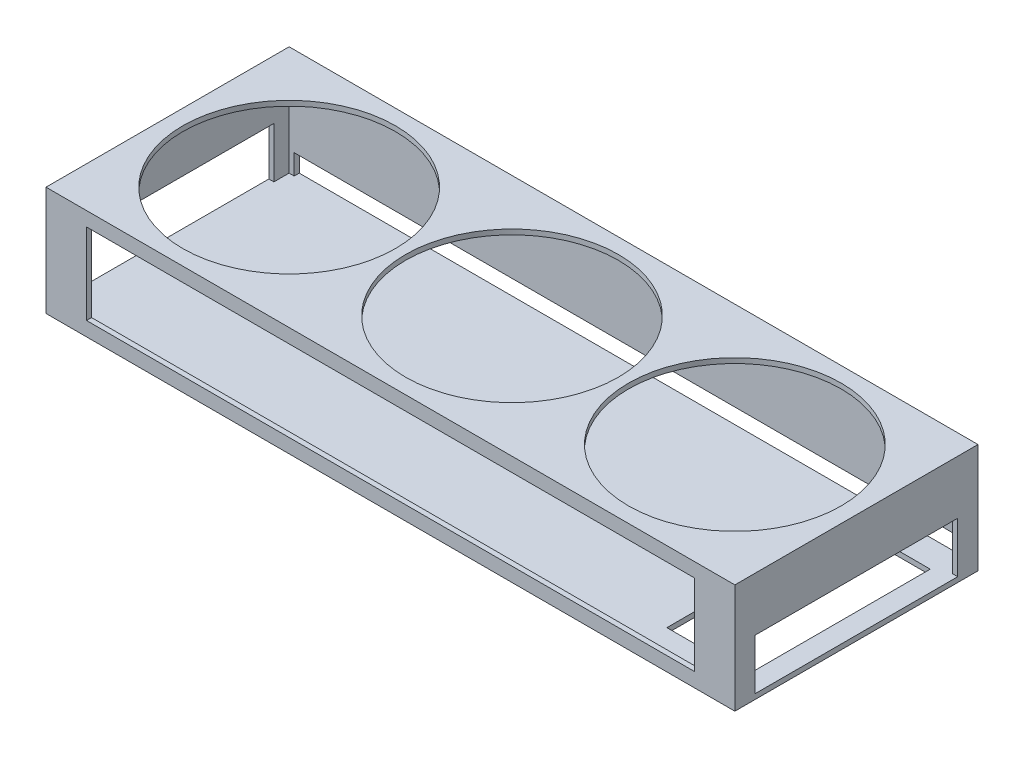
ISO-10303-21;
HEADER;
FILE_DESCRIPTION(('STEP AP214'),'2;1');
FILE_NAME('part.step','',(''),(''),'','','');
FILE_SCHEMA(('AUTOMOTIVE_DESIGN { 1 0 10303 214 1 1 1 1 }'));
ENDSEC;
DATA;
#1=APPLICATION_CONTEXT('core data for automotive mechanical design processes');
#2=APPLICATION_PROTOCOL_DEFINITION('international standard','automotive_design',2000,#1);
#3=PRODUCT_CONTEXT('',#1,'mechanical');
#4=PRODUCT('Part','Part','',(#3));
#5=PRODUCT_RELATED_PRODUCT_CATEGORY('part','',(#4));
#6=PRODUCT_DEFINITION_FORMATION('','',#4);
#7=PRODUCT_DEFINITION_CONTEXT('part definition',#1,'design');
#8=PRODUCT_DEFINITION('design','',#6,#7);
#9=PRODUCT_DEFINITION_SHAPE('','',#8);
#10=(LENGTH_UNIT() NAMED_UNIT(*) SI_UNIT(.MILLI.,.METRE.));
#11=(NAMED_UNIT(*) PLANE_ANGLE_UNIT() SI_UNIT($,.RADIAN.));
#12=(NAMED_UNIT(*) SI_UNIT($,.STERADIAN.) SOLID_ANGLE_UNIT());
#13=UNCERTAINTY_MEASURE_WITH_UNIT(LENGTH_MEASURE(1.E-05),#10,'distance_accuracy_value','');
#14=(GEOMETRIC_REPRESENTATION_CONTEXT(3) GLOBAL_UNCERTAINTY_ASSIGNED_CONTEXT((#13)) GLOBAL_UNIT_ASSIGNED_CONTEXT((#10,
#11,#12)) REPRESENTATION_CONTEXT('',''));
#15=CARTESIAN_POINT('',(0.,0.,0.));
#16=DIRECTION('',(0.,0.,1.));
#17=DIRECTION('',(1.,0.,0.));
#18=AXIS2_PLACEMENT_3D('',#15,#16,#17);
#19=CARTESIAN_POINT('',(167.5,-27.,120.));
#20=DIRECTION('',(-1.,0.,0.));
#21=DIRECTION('',(0.,0.,1.));
#22=AXIS2_PLACEMENT_3D('',#19,#20,#21);
#23=PLANE('',#22);
#24=DIRECTION('',(0.,-1.,0.));
#25=VECTOR('',#24,1.);
#26=CARTESIAN_POINT('',(167.5,-27.,9.99999999999999));
#27=LINE('',#26,#25);
#28=CARTESIAN_POINT('',(167.5,0.499999999999999,9.99999999999999));
#29=VERTEX_POINT('',#28);
#30=CARTESIAN_POINT('',(167.5,-24.5,9.99999999999999));
#31=VERTEX_POINT('',#30);
#32=EDGE_CURVE('E383',#29,#31,#27,.T.);
#33=ORIENTED_EDGE('',*,*,#32,.F.);
#34=DIRECTION('',(0.,0.,-1.));
#35=VECTOR('',#34,1.);
#36=CARTESIAN_POINT('',(167.5,0.5,120.));
#37=LINE('',#36,#35);
#38=CARTESIAN_POINT('',(167.5,0.5,110.));
#39=VERTEX_POINT('',#38);
#40=EDGE_CURVE('E369',#39,#29,#37,.T.);
#41=ORIENTED_EDGE('',*,*,#40,.F.);
#42=DIRECTION('',(0.,1.,0.));
#43=VECTOR('',#42,1.);
#44=CARTESIAN_POINT('',(167.5,-27.,110.));
#45=LINE('',#44,#43);
#46=CARTESIAN_POINT('',(167.5,-24.5,110.));
#47=VERTEX_POINT('',#46);
#48=EDGE_CURVE('E375',#47,#39,#45,.T.);
#49=ORIENTED_EDGE('',*,*,#48,.F.);
#50=DIRECTION('',(0.,0.,-1.));
#51=VECTOR('',#50,1.);
#52=CARTESIAN_POINT('',(167.5,-24.5,120.));
#53=LINE('',#52,#51);
#54=CARTESIAN_POINT('',(167.5,-24.5,117.5));
#55=VERTEX_POINT('',#54);
#56=EDGE_CURVE('E516',#55,#47,#53,.T.);
#57=ORIENTED_EDGE('',*,*,#56,.F.);
#58=DIRECTION('',(0.,1.,0.));
#59=VECTOR('',#58,1.);
#60=CARTESIAN_POINT('',(167.5,0.,117.5));
#61=LINE('',#60,#59);
#62=CARTESIAN_POINT('',(167.5,24.5,117.5));
#63=VERTEX_POINT('',#62);
#64=EDGE_CURVE('E488',#55,#63,#61,.T.);
#65=ORIENTED_EDGE('',*,*,#64,.T.);
#66=DIRECTION('',(0.,0.,-1.));
#67=VECTOR('',#66,1.);
#68=CARTESIAN_POINT('',(167.5,24.5,120.));
#69=LINE('',#68,#67);
#70=CARTESIAN_POINT('',(167.5,24.5,2.5));
#71=VERTEX_POINT('',#70);
#72=EDGE_CURVE('E509',#63,#71,#69,.T.);
#73=ORIENTED_EDGE('',*,*,#72,.T.);
#74=DIRECTION('',(0.,1.,0.));
#75=VECTOR('',#74,1.);
#76=CARTESIAN_POINT('',(167.5,0.,2.5));
#77=LINE('',#76,#75);
#78=CARTESIAN_POINT('',(167.5,-24.5,2.5));
#79=VERTEX_POINT('',#78);
#80=EDGE_CURVE('E481',#79,#71,#77,.T.);
#81=ORIENTED_EDGE('',*,*,#80,.F.);
#82=EDGE_CURVE('E520',#31,#79,#53,.T.);
#83=ORIENTED_EDGE('',*,*,#82,.F.);
#84=EDGE_LOOP('',(#33,#41,#49,#57,#65,#73,#81,#83));
#85=FACE_BOUND('',#84,.T.);
#86=ADVANCED_FACE('F42',(#85),#23,.T.);
#87=CARTESIAN_POINT('',(-170.,24.5,120.));
#88=DIRECTION('',(0.,-1.,0.));
#89=DIRECTION('',(0.,0.,-1.));
#90=AXIS2_PLACEMENT_3D('',#87,#88,#89);
#91=PLANE('',#90);
#92=CARTESIAN_POINT('',(-110.,24.5,60.));
#93=DIRECTION('',(0.,-1.,0.));
#94=DIRECTION('',(0.,0.,-1.));
#95=AXIS2_PLACEMENT_3D('',#92,#93,#94);
#96=CIRCLE('',#95,52.5);
#97=CARTESIAN_POINT('',(-110.,24.5,7.5));
#98=VERTEX_POINT('',#97);
#99=EDGE_CURVE('E46',#98,#98,#96,.T.);
#100=ORIENTED_EDGE('',*,*,#99,.F.);
#101=EDGE_LOOP('',(#100));
#102=FACE_BOUND('',#101,.T.);
#103=CARTESIAN_POINT('',(0.,24.5,60.));
#104=DIRECTION('',(0.,-1.,0.));
#105=DIRECTION('',(0.,0.,-1.));
#106=AXIS2_PLACEMENT_3D('',#103,#104,#105);
#107=CIRCLE('',#106,52.5);
#108=CARTESIAN_POINT('',(0.,24.5,7.5));
#109=VERTEX_POINT('',#108);
#110=EDGE_CURVE('E526',#109,#109,#107,.T.);
#111=ORIENTED_EDGE('',*,*,#110,.F.);
#112=EDGE_LOOP('',(#111));
#113=FACE_BOUND('',#112,.T.);
#114=CARTESIAN_POINT('',(110.,24.5,60.));
#115=DIRECTION('',(0.,-1.,0.));
#116=DIRECTION('',(0.,0.,-1.));
#117=AXIS2_PLACEMENT_3D('',#114,#115,#116);
#118=CIRCLE('',#117,52.5);
#119=CARTESIAN_POINT('',(110.,24.5,7.49999999999999));
#120=VERTEX_POINT('',#119);
#121=EDGE_CURVE('E432',#120,#120,#118,.T.);
#122=ORIENTED_EDGE('',*,*,#121,.F.);
#123=EDGE_LOOP('',(#122));
#124=FACE_BOUND('',#123,.T.);
#125=DIRECTION('',(-1.,0.,0.));
#126=VECTOR('',#125,1.);
#127=CARTESIAN_POINT('',(0.,24.5,2.5));
#128=LINE('',#127,#126);
#129=CARTESIAN_POINT('',(-167.5,24.5,2.5));
#130=VERTEX_POINT('',#129);
#131=EDGE_CURVE('E513',#71,#130,#128,.T.);
#132=ORIENTED_EDGE('',*,*,#131,.F.);
#133=ORIENTED_EDGE('',*,*,#72,.F.);
#134=DIRECTION('',(-1.,0.,0.));
#135=VECTOR('',#134,1.);
#136=CARTESIAN_POINT('',(0.,24.5,117.5));
#137=LINE('',#136,#135);
#138=CARTESIAN_POINT('',(-167.5,24.5,117.5));
#139=VERTEX_POINT('',#138);
#140=EDGE_CURVE('E485',#63,#139,#137,.T.);
#141=ORIENTED_EDGE('',*,*,#140,.T.);
#142=DIRECTION('',(0.,0.,-1.));
#143=VECTOR('',#142,1.);
#144=CARTESIAN_POINT('',(-167.5,24.5,120.));
#145=LINE('',#144,#143);
#146=EDGE_CURVE('E501',#139,#130,#145,.T.);
#147=ORIENTED_EDGE('',*,*,#146,.T.);
#148=EDGE_LOOP('',(#132,#133,#141,#147));
#149=FACE_BOUND('',#148,.T.);
#150=ADVANCED_FACE('F538',(#102,#113,#124,#149),#91,.T.);
#151=CARTESIAN_POINT('',(-167.5,-27.,120.));
#152=DIRECTION('',(1.,0.,0.));
#153=DIRECTION('',(0.,0.,-1.));
#154=AXIS2_PLACEMENT_3D('',#151,#152,#153);
#155=PLANE('',#154);
#156=DIRECTION('',(0.,1.,0.));
#157=VECTOR('',#156,1.);
#158=CARTESIAN_POINT('',(-167.5,-27.,9.99999999999999));
#159=LINE('',#158,#157);
#160=CARTESIAN_POINT('',(-167.5,-24.5,9.99999999999999));
#161=VERTEX_POINT('',#160);
#162=CARTESIAN_POINT('',(-167.5,0.5,9.99999999999999));
#163=VERTEX_POINT('',#162);
#164=EDGE_CURVE('E379',#161,#163,#159,.T.);
#165=ORIENTED_EDGE('',*,*,#164,.F.);
#166=DIRECTION('',(0.,0.,-1.));
#167=VECTOR('',#166,1.);
#168=CARTESIAN_POINT('',(-167.5,-24.5,120.));
#169=LINE('',#168,#167);
#170=CARTESIAN_POINT('',(-167.5,-24.5,2.5));
#171=VERTEX_POINT('',#170);
#172=EDGE_CURVE('E496',#161,#171,#169,.T.);
#173=ORIENTED_EDGE('',*,*,#172,.T.);
#174=DIRECTION('',(0.,-1.,0.));
#175=VECTOR('',#174,1.);
#176=CARTESIAN_POINT('',(-167.5,0.,2.5));
#177=LINE('',#176,#175);
#178=EDGE_CURVE('E505',#130,#171,#177,.T.);
#179=ORIENTED_EDGE('',*,*,#178,.F.);
#180=ORIENTED_EDGE('',*,*,#146,.F.);
#181=DIRECTION('',(0.,-1.,0.));
#182=VECTOR('',#181,1.);
#183=CARTESIAN_POINT('',(-167.5,0.,117.5));
#184=LINE('',#183,#182);
#185=CARTESIAN_POINT('',(-167.5,-24.5,117.5));
#186=VERTEX_POINT('',#185);
#187=EDGE_CURVE('E52',#139,#186,#184,.T.);
#188=ORIENTED_EDGE('',*,*,#187,.T.);
#189=CARTESIAN_POINT('',(-167.5,-24.5,110.));
#190=VERTEX_POINT('',#189);
#191=EDGE_CURVE('E492',#186,#190,#169,.T.);
#192=ORIENTED_EDGE('',*,*,#191,.T.);
#193=DIRECTION('',(0.,-1.,0.));
#194=VECTOR('',#193,1.);
#195=CARTESIAN_POINT('',(-167.5,-27.,110.));
#196=LINE('',#195,#194);
#197=CARTESIAN_POINT('',(-167.5,0.499999999999999,110.));
#198=VERTEX_POINT('',#197);
#199=EDGE_CURVE('E372',#198,#190,#196,.T.);
#200=ORIENTED_EDGE('',*,*,#199,.F.);
#201=DIRECTION('',(0.,0.,1.));
#202=VECTOR('',#201,1.);
#203=CARTESIAN_POINT('',(-167.5,0.5,120.));
#204=LINE('',#203,#202);
#205=EDGE_CURVE('E352',#163,#198,#204,.T.);
#206=ORIENTED_EDGE('',*,*,#205,.F.);
#207=EDGE_LOOP('',(#165,#173,#179,#180,#188,#192,#200,#206));
#208=FACE_BOUND('',#207,.T.);
#209=ADVANCED_FACE('F541',(#208),#155,.T.);
#210=CARTESIAN_POINT('',(-170.,-24.5,120.));
#211=DIRECTION('',(0.,1.,0.));
#212=DIRECTION('',(0.,0.,1.));
#213=AXIS2_PLACEMENT_3D('',#210,#211,#212);
#214=PLANE('',#213);
#215=DIRECTION('',(1.,0.,0.));
#216=VECTOR('',#215,1.);
#217=CARTESIAN_POINT('',(0.,-24.5,2.5));
#218=LINE('',#217,#216);
#219=CARTESIAN_POINT('',(165.,-24.5,2.5));
#220=VERTEX_POINT('',#219);
#221=EDGE_CURVE('E500',#220,#79,#218,.T.);
#222=ORIENTED_EDGE('',*,*,#221,.F.);
#223=DIRECTION('',(0.,0.,-1.));
#224=VECTOR('',#223,1.);
#225=CARTESIAN_POINT('',(165.,-24.5,9.9999999999999));
#226=LINE('',#225,#224);
#227=CARTESIAN_POINT('',(165.,-24.5,0.));
#228=VERTEX_POINT('',#227);
#229=EDGE_CURVE('E239',#220,#228,#226,.T.);
#230=ORIENTED_EDGE('',*,*,#229,.T.);
#231=DIRECTION('',(-1.,0.,0.));
#232=VECTOR('',#231,1.);
#233=CARTESIAN_POINT('',(-165.,-24.5,0.));
#234=LINE('',#233,#232);
#235=CARTESIAN_POINT('',(-165.,-24.5,0.));
#236=VERTEX_POINT('',#235);
#237=EDGE_CURVE('E242',#228,#236,#234,.T.);
#238=ORIENTED_EDGE('',*,*,#237,.T.);
#239=DIRECTION('',(0.,0.,-1.));
#240=VECTOR('',#239,1.);
#241=CARTESIAN_POINT('',(-165.,-24.5,9.9999999999999));
#242=LINE('',#241,#240);
#243=CARTESIAN_POINT('',(-165.,-24.5,2.5));
#244=VERTEX_POINT('',#243);
#245=EDGE_CURVE('E60',#244,#236,#242,.T.);
#246=ORIENTED_EDGE('',*,*,#245,.F.);
#247=EDGE_CURVE('E497',#171,#244,#218,.T.);
#248=ORIENTED_EDGE('',*,*,#247,.F.);
#249=ORIENTED_EDGE('',*,*,#172,.F.);
#250=DIRECTION('',(1.,0.,0.));
#251=VECTOR('',#250,1.);
#252=CARTESIAN_POINT('',(-170.,-24.5,9.99999999999999));
#253=LINE('',#252,#251);
#254=CARTESIAN_POINT('',(-170.,-24.5,9.99999999999999));
#255=VERTEX_POINT('',#254);
#256=EDGE_CURVE('E349',#255,#161,#253,.T.);
#257=ORIENTED_EDGE('',*,*,#256,.F.);
#258=DIRECTION('',(0.,0.,-1.));
#259=VECTOR('',#258,1.);
#260=CARTESIAN_POINT('',(-170.,-24.5,110.));
#261=LINE('',#260,#259);
#262=CARTESIAN_POINT('',(-170.,-24.5,110.));
#263=VERTEX_POINT('',#262);
#264=EDGE_CURVE('E331',#263,#255,#261,.T.);
#265=ORIENTED_EDGE('',*,*,#264,.F.);
#266=DIRECTION('',(1.,0.,0.));
#267=VECTOR('',#266,1.);
#268=CARTESIAN_POINT('',(-170.,-24.5,110.));
#269=LINE('',#268,#267);
#270=EDGE_CURVE('E354',#263,#190,#269,.T.);
#271=ORIENTED_EDGE('',*,*,#270,.T.);
#272=ORIENTED_EDGE('',*,*,#191,.F.);
#273=DIRECTION('',(1.,0.,0.));
#274=VECTOR('',#273,1.);
#275=CARTESIAN_POINT('',(0.,-24.5,117.5));
#276=LINE('',#275,#274);
#277=EDGE_CURVE('E11',#186,#55,#276,.T.);
#278=ORIENTED_EDGE('',*,*,#277,.T.);
#279=ORIENTED_EDGE('',*,*,#56,.T.);
#280=CARTESIAN_POINT('',(170.,-24.5,110.));
#281=VERTEX_POINT('',#280);
#282=EDGE_CURVE('E358',#47,#281,#269,.T.);
#283=ORIENTED_EDGE('',*,*,#282,.T.);
#284=DIRECTION('',(0.,0.,-1.));
#285=VECTOR('',#284,1.);
#286=CARTESIAN_POINT('',(170.,-24.5,110.));
#287=LINE('',#286,#285);
#288=CARTESIAN_POINT('',(170.,-24.5,9.99999999999999));
#289=VERTEX_POINT('',#288);
#290=EDGE_CURVE('E323',#281,#289,#287,.T.);
#291=ORIENTED_EDGE('',*,*,#290,.T.);
#292=EDGE_CURVE('E353',#31,#289,#253,.T.);
#293=ORIENTED_EDGE('',*,*,#292,.F.);
#294=ORIENTED_EDGE('',*,*,#82,.T.);
#295=EDGE_LOOP('',(#222,#230,#238,#246,#248,#249,#257,#265,#271,#272,#278,#279,#283,#291,#293,#294));
#296=FACE_BOUND('',#295,.T.);
#297=DIRECTION('',(0.,0.,-1.));
#298=VECTOR('',#297,1.);
#299=CARTESIAN_POINT('',(160.,-24.5,120.));
#300=LINE('',#299,#298);
#301=CARTESIAN_POINT('',(160.,-24.5,103.556553439785));
#302=VERTEX_POINT('',#301);
#303=CARTESIAN_POINT('',(160.,-24.5,13.5565534397847));
#304=VERTEX_POINT('',#303);
#305=EDGE_CURVE('E314',#302,#304,#300,.T.);
#306=ORIENTED_EDGE('',*,*,#305,.F.);
#307=DIRECTION('',(1.,0.,0.));
#308=VECTOR('',#307,1.);
#309=CARTESIAN_POINT('',(-170.,-24.5,103.556553439785));
#310=LINE('',#309,#308);
#311=CARTESIAN_POINT('',(120.,-24.5,103.556553439785));
#312=VERTEX_POINT('',#311);
#313=EDGE_CURVE('E295',#312,#302,#310,.T.);
#314=ORIENTED_EDGE('',*,*,#313,.F.);
#315=DIRECTION('',(0.,0.,1.));
#316=VECTOR('',#315,1.);
#317=CARTESIAN_POINT('',(120.,-24.5,120.));
#318=LINE('',#317,#316);
#319=CARTESIAN_POINT('',(120.,-24.5,13.5565534397847));
#320=VERTEX_POINT('',#319);
#321=EDGE_CURVE('E307',#320,#312,#318,.T.);
#322=ORIENTED_EDGE('',*,*,#321,.F.);
#323=DIRECTION('',(-1.,0.,0.));
#324=VECTOR('',#323,1.);
#325=CARTESIAN_POINT('',(-170.,-24.5,13.5565534397847));
#326=LINE('',#325,#324);
#327=EDGE_CURVE('E311',#304,#320,#326,.T.);
#328=ORIENTED_EDGE('',*,*,#327,.F.);
#329=EDGE_LOOP('',(#306,#314,#322,#328));
#330=FACE_BOUND('',#329,.T.);
#331=ADVANCED_FACE('F244',(#296,#330),#214,.T.);
#332=CARTESIAN_POINT('',(0.,0.,117.5));
#333=DIRECTION('',(0.,0.,-1.));
#334=DIRECTION('',(-1.,0.,0.));
#335=AXIS2_PLACEMENT_3D('',#332,#333,#334);
#336=PLANE('',#335);
#337=DIRECTION('',(0.,-1.,0.));
#338=VECTOR('',#337,1.);
#339=CARTESIAN_POINT('',(150.,0.,117.5));
#340=LINE('',#339,#338);
#341=CARTESIAN_POINT('',(150.,20.,117.5));
#342=VERTEX_POINT('',#341);
#343=CARTESIAN_POINT('',(150.,-20.,117.5));
#344=VERTEX_POINT('',#343);
#345=EDGE_CURVE('E424',#342,#344,#340,.T.);
#346=ORIENTED_EDGE('',*,*,#345,.F.);
#347=DIRECTION('',(1.,0.,0.));
#348=VECTOR('',#347,1.);
#349=CARTESIAN_POINT('',(0.,20.,117.5));
#350=LINE('',#349,#348);
#351=CARTESIAN_POINT('',(-150.,20.,117.5));
#352=VERTEX_POINT('',#351);
#353=EDGE_CURVE('E405',#352,#342,#350,.T.);
#354=ORIENTED_EDGE('',*,*,#353,.F.);
#355=DIRECTION('',(0.,1.,0.));
#356=VECTOR('',#355,1.);
#357=CARTESIAN_POINT('',(-150.,0.,117.5));
#358=LINE('',#357,#356);
#359=CARTESIAN_POINT('',(-150.,-20.,117.5));
#360=VERTEX_POINT('',#359);
#361=EDGE_CURVE('E417',#360,#352,#358,.T.);
#362=ORIENTED_EDGE('',*,*,#361,.F.);
#363=DIRECTION('',(-1.,0.,0.));
#364=VECTOR('',#363,1.);
#365=CARTESIAN_POINT('',(0.,-20.,117.5));
#366=LINE('',#365,#364);
#367=EDGE_CURVE('E421',#344,#360,#366,.T.);
#368=ORIENTED_EDGE('',*,*,#367,.F.);
#369=EDGE_LOOP('',(#346,#354,#362,#368));
#370=FACE_BOUND('',#369,.T.);
#371=ORIENTED_EDGE('',*,*,#64,.F.);
#372=ORIENTED_EDGE('',*,*,#277,.F.);
#373=ORIENTED_EDGE('',*,*,#187,.F.);
#374=ORIENTED_EDGE('',*,*,#140,.F.);
#375=EDGE_LOOP('',(#371,#372,#373,#374));
#376=FACE_BOUND('',#375,.T.);
#377=ADVANCED_FACE('F594',(#370,#376),#336,.T.);
#378=CARTESIAN_POINT('',(0.,0.,2.5));
#379=DIRECTION('',(0.,0.,-1.));
#380=DIRECTION('',(-1.,0.,0.));
#381=AXIS2_PLACEMENT_3D('',#378,#379,#380);
#382=PLANE('',#381);
#383=DIRECTION('',(1.,0.,0.));
#384=VECTOR('',#383,1.);
#385=CARTESIAN_POINT('',(0.,-14.5,2.5));
#386=LINE('',#385,#384);
#387=CARTESIAN_POINT('',(-165.,-14.5,2.5));
#388=VERTEX_POINT('',#387);
#389=CARTESIAN_POINT('',(165.,-14.5,2.5));
#390=VERTEX_POINT('',#389);
#391=EDGE_CURVE('E268',#388,#390,#386,.T.);
#392=ORIENTED_EDGE('',*,*,#391,.T.);
#393=DIRECTION('',(0.,-1.,0.));
#394=VECTOR('',#393,1.);
#395=CARTESIAN_POINT('',(165.,0.,2.5));
#396=LINE('',#395,#394);
#397=EDGE_CURVE('E272',#390,#220,#396,.T.);
#398=ORIENTED_EDGE('',*,*,#397,.T.);
#399=ORIENTED_EDGE('',*,*,#221,.T.);
#400=ORIENTED_EDGE('',*,*,#80,.T.);
#401=ORIENTED_EDGE('',*,*,#131,.T.);
#402=ORIENTED_EDGE('',*,*,#178,.T.);
#403=ORIENTED_EDGE('',*,*,#247,.T.);
#404=DIRECTION('',(0.,1.,0.));
#405=VECTOR('',#404,1.);
#406=CARTESIAN_POINT('',(-165.,0.,2.5));
#407=LINE('',#406,#405);
#408=EDGE_CURVE('E235',#244,#388,#407,.T.);
#409=ORIENTED_EDGE('',*,*,#408,.T.);
#410=EDGE_LOOP('',(#392,#398,#399,#400,#401,#402,#403,#409));
#411=FACE_BOUND('',#410,.T.);
#412=ADVANCED_FACE('F44',(#411),#382,.F.);
#413=CARTESIAN_POINT('',(110.,17.0000000000001,60.));
#414=DIRECTION('',(0.,1.,0.));
#415=DIRECTION('',(0.,0.,1.));
#416=AXIS2_PLACEMENT_3D('',#413,#414,#415);
#417=CYLINDRICAL_SURFACE('',#416,52.5);
#418=ORIENTED_EDGE('',*,*,#121,.T.);
#419=EDGE_LOOP('',(#418));
#420=FACE_BOUND('',#419,.T.);
#421=CARTESIAN_POINT('',(110.,27.,60.));
#422=DIRECTION('',(0.,1.,0.));
#423=DIRECTION('',(0.,0.,1.));
#424=AXIS2_PLACEMENT_3D('',#421,#422,#423);
#425=CIRCLE('',#424,52.5);
#426=CARTESIAN_POINT('',(110.,27.,112.5));
#427=VERTEX_POINT('',#426);
#428=EDGE_CURVE('E427',#427,#427,#425,.T.);
#429=ORIENTED_EDGE('',*,*,#428,.T.);
#430=EDGE_LOOP('',(#429));
#431=FACE_BOUND('',#430,.T.);
#432=ADVANCED_FACE('F602',(#420,#431),#417,.F.);
#433=CARTESIAN_POINT('',(0.,17.0000000000001,60.));
#434=DIRECTION('',(0.,1.,0.));
#435=DIRECTION('',(0.,0.,1.));
#436=AXIS2_PLACEMENT_3D('',#433,#434,#435);
#437=CYLINDRICAL_SURFACE('',#436,52.5);
#438=ORIENTED_EDGE('',*,*,#110,.T.);
#439=EDGE_LOOP('',(#438));
#440=FACE_BOUND('',#439,.T.);
#441=CARTESIAN_POINT('',(0.,27.,60.));
#442=DIRECTION('',(0.,1.,0.));
#443=DIRECTION('',(0.,0.,1.));
#444=AXIS2_PLACEMENT_3D('',#441,#442,#443);
#445=CIRCLE('',#444,52.5);
#446=CARTESIAN_POINT('',(0.,27.,112.5));
#447=VERTEX_POINT('',#446);
#448=EDGE_CURVE('E433',#447,#447,#445,.T.);
#449=ORIENTED_EDGE('',*,*,#448,.T.);
#450=EDGE_LOOP('',(#449));
#451=FACE_BOUND('',#450,.T.);
#452=ADVANCED_FACE('F662',(#440,#451),#437,.F.);
#453=CARTESIAN_POINT('',(-110.,17.0000000000001,60.));
#454=DIRECTION('',(0.,1.,0.));
#455=DIRECTION('',(0.,0.,1.));
#456=AXIS2_PLACEMENT_3D('',#453,#454,#455);
#457=CYLINDRICAL_SURFACE('',#456,52.5);
#458=ORIENTED_EDGE('',*,*,#99,.T.);
#459=EDGE_LOOP('',(#458));
#460=FACE_BOUND('',#459,.T.);
#461=CARTESIAN_POINT('',(-110.,27.,60.));
#462=DIRECTION('',(0.,1.,0.));
#463=DIRECTION('',(0.,0.,1.));
#464=AXIS2_PLACEMENT_3D('',#461,#462,#463);
#465=CIRCLE('',#464,52.5);
#466=CARTESIAN_POINT('',(-110.,27.,112.5));
#467=VERTEX_POINT('',#466);
#468=EDGE_CURVE('E428',#467,#467,#465,.T.);
#469=ORIENTED_EDGE('',*,*,#468,.T.);
#470=EDGE_LOOP('',(#469));
#471=FACE_BOUND('',#470,.T.);
#472=ADVANCED_FACE('F535',(#460,#471),#457,.F.);
#473=CARTESIAN_POINT('',(170.,-27.,120.));
#474=DIRECTION('',(-1.,0.,0.));
#475=DIRECTION('',(0.,0.,1.));
#476=AXIS2_PLACEMENT_3D('',#473,#474,#475);
#477=PLANE('',#476);
#478=DIRECTION('',(0.,0.,1.));
#479=VECTOR('',#478,1.);
#480=CARTESIAN_POINT('',(170.,0.499999999999999,110.));
#481=LINE('',#480,#479);
#482=CARTESIAN_POINT('',(170.,0.5,9.99999999999999));
#483=VERTEX_POINT('',#482);
#484=CARTESIAN_POINT('',(170.,0.499999999999999,110.));
#485=VERTEX_POINT('',#484);
#486=EDGE_CURVE('E338',#483,#485,#481,.T.);
#487=ORIENTED_EDGE('',*,*,#486,.F.);
#488=DIRECTION('',(0.,1.,0.));
#489=VECTOR('',#488,1.);
#490=CARTESIAN_POINT('',(170.,0.499999999999999,9.99999999999999));
#491=LINE('',#490,#489);
#492=EDGE_CURVE('E317',#289,#483,#491,.T.);
#493=ORIENTED_EDGE('',*,*,#492,.F.);
#494=ORIENTED_EDGE('',*,*,#290,.F.);
#495=DIRECTION('',(0.,-1.,0.));
#496=VECTOR('',#495,1.);
#497=CARTESIAN_POINT('',(170.,0.499999999999999,110.));
#498=LINE('',#497,#496);
#499=EDGE_CURVE('E342',#485,#281,#498,.T.);
#500=ORIENTED_EDGE('',*,*,#499,.F.);
#501=EDGE_LOOP('',(#487,#493,#494,#500));
#502=FACE_BOUND('',#501,.T.);
#503=DIRECTION('',(0.,1.,0.));
#504=VECTOR('',#503,1.);
#505=CARTESIAN_POINT('',(170.,-27.,0.));
#506=LINE('',#505,#504);
#507=CARTESIAN_POINT('',(170.,-27.,0.));
#508=VERTEX_POINT('',#507);
#509=CARTESIAN_POINT('',(170.,27.,0.));
#510=VERTEX_POINT('',#509);
#511=EDGE_CURVE('E455',#508,#510,#506,.T.);
#512=ORIENTED_EDGE('',*,*,#511,.T.);
#513=DIRECTION('',(0.,0.,-1.));
#514=VECTOR('',#513,1.);
#515=CARTESIAN_POINT('',(170.,27.,120.));
#516=LINE('',#515,#514);
#517=CARTESIAN_POINT('',(170.,27.,120.));
#518=VERTEX_POINT('',#517);
#519=EDGE_CURVE('E478',#518,#510,#516,.T.);
#520=ORIENTED_EDGE('',*,*,#519,.F.);
#521=DIRECTION('',(0.,1.,0.));
#522=VECTOR('',#521,1.);
#523=CARTESIAN_POINT('',(170.,-27.,120.));
#524=LINE('',#523,#522);
#525=CARTESIAN_POINT('',(170.,-27.,120.));
#526=VERTEX_POINT('',#525);
#527=EDGE_CURVE('E440',#526,#518,#524,.T.);
#528=ORIENTED_EDGE('',*,*,#527,.F.);
#529=DIRECTION('',(0.,0.,-1.));
#530=VECTOR('',#529,1.);
#531=CARTESIAN_POINT('',(170.,-27.,120.));
#532=LINE('',#531,#530);
#533=EDGE_CURVE('E454',#526,#508,#532,.T.);
#534=ORIENTED_EDGE('',*,*,#533,.T.);
#535=EDGE_LOOP('',(#512,#520,#528,#534));
#536=FACE_BOUND('',#535,.T.);
#537=ADVANCED_FACE('F589',(#502,#536),#477,.F.);
#538=CARTESIAN_POINT('',(-170.,27.,120.));
#539=DIRECTION('',(0.,-1.,0.));
#540=DIRECTION('',(0.,0.,-1.));
#541=AXIS2_PLACEMENT_3D('',#538,#539,#540);
#542=PLANE('',#541);
#543=ORIENTED_EDGE('',*,*,#468,.F.);
#544=EDGE_LOOP('',(#543));
#545=FACE_BOUND('',#544,.T.);
#546=ORIENTED_EDGE('',*,*,#448,.F.);
#547=EDGE_LOOP('',(#546));
#548=FACE_BOUND('',#547,.T.);
#549=ORIENTED_EDGE('',*,*,#428,.F.);
#550=EDGE_LOOP('',(#549));
#551=FACE_BOUND('',#550,.T.);
#552=DIRECTION('',(-1.,0.,0.));
#553=VECTOR('',#552,1.);
#554=CARTESIAN_POINT('',(-170.,27.,0.));
#555=LINE('',#554,#553);
#556=CARTESIAN_POINT('',(-170.,27.,0.));
#557=VERTEX_POINT('',#556);
#558=EDGE_CURVE('E459',#510,#557,#555,.T.);
#559=ORIENTED_EDGE('',*,*,#558,.T.);
#560=DIRECTION('',(0.,0.,-1.));
#561=VECTOR('',#560,1.);
#562=CARTESIAN_POINT('',(-170.,27.,120.));
#563=LINE('',#562,#561);
#564=CARTESIAN_POINT('',(-170.,27.,120.));
#565=VERTEX_POINT('',#564);
#566=EDGE_CURVE('E474',#565,#557,#563,.T.);
#567=ORIENTED_EDGE('',*,*,#566,.F.);
#568=DIRECTION('',(-1.,0.,0.));
#569=VECTOR('',#568,1.);
#570=CARTESIAN_POINT('',(-170.,27.,120.));
#571=LINE('',#570,#569);
#572=EDGE_CURVE('E444',#518,#565,#571,.T.);
#573=ORIENTED_EDGE('',*,*,#572,.F.);
#574=ORIENTED_EDGE('',*,*,#519,.T.);
#575=EDGE_LOOP('',(#559,#567,#573,#574));
#576=FACE_BOUND('',#575,.T.);
#577=ADVANCED_FACE('F626',(#545,#548,#551,#576),#542,.F.);
#578=CARTESIAN_POINT('',(-170.,-27.,120.));
#579=DIRECTION('',(1.,0.,0.));
#580=DIRECTION('',(0.,0.,-1.));
#581=AXIS2_PLACEMENT_3D('',#578,#579,#580);
#582=PLANE('',#581);
#583=ORIENTED_EDGE('',*,*,#264,.T.);
#584=DIRECTION('',(0.,1.,0.));
#585=VECTOR('',#584,1.);
#586=CARTESIAN_POINT('',(-170.,0.499999999999999,9.99999999999999));
#587=LINE('',#586,#585);
#588=CARTESIAN_POINT('',(-170.,0.499999999999999,9.99999999999999));
#589=VERTEX_POINT('',#588);
#590=EDGE_CURVE('E318',#255,#589,#587,.T.);
#591=ORIENTED_EDGE('',*,*,#590,.T.);
#592=DIRECTION('',(0.,0.,1.));
#593=VECTOR('',#592,1.);
#594=CARTESIAN_POINT('',(-170.,0.499999999999999,110.));
#595=LINE('',#594,#593);
#596=CARTESIAN_POINT('',(-170.,0.5,110.));
#597=VERTEX_POINT('',#596);
#598=EDGE_CURVE('E322',#589,#597,#595,.T.);
#599=ORIENTED_EDGE('',*,*,#598,.T.);
#600=DIRECTION('',(0.,-1.,0.));
#601=VECTOR('',#600,1.);
#602=CARTESIAN_POINT('',(-170.,0.499999999999999,110.));
#603=LINE('',#602,#601);
#604=EDGE_CURVE('E327',#597,#263,#603,.T.);
#605=ORIENTED_EDGE('',*,*,#604,.T.);
#606=EDGE_LOOP('',(#583,#591,#599,#605));
#607=FACE_BOUND('',#606,.T.);
#608=DIRECTION('',(0.,-1.,0.));
#609=VECTOR('',#608,1.);
#610=CARTESIAN_POINT('',(-170.,-27.,0.));
#611=LINE('',#610,#609);
#612=CARTESIAN_POINT('',(-170.,-27.,0.));
#613=VERTEX_POINT('',#612);
#614=EDGE_CURVE('E462',#557,#613,#611,.T.);
#615=ORIENTED_EDGE('',*,*,#614,.T.);
#616=DIRECTION('',(0.,0.,-1.));
#617=VECTOR('',#616,1.);
#618=CARTESIAN_POINT('',(-170.,-27.,120.));
#619=LINE('',#618,#617);
#620=CARTESIAN_POINT('',(-170.,-27.,120.));
#621=VERTEX_POINT('',#620);
#622=EDGE_CURVE('E470',#621,#613,#619,.T.);
#623=ORIENTED_EDGE('',*,*,#622,.F.);
#624=DIRECTION('',(0.,-1.,0.));
#625=VECTOR('',#624,1.);
#626=CARTESIAN_POINT('',(-170.,-27.,120.));
#627=LINE('',#626,#625);
#628=EDGE_CURVE('E448',#565,#621,#627,.T.);
#629=ORIENTED_EDGE('',*,*,#628,.F.);
#630=ORIENTED_EDGE('',*,*,#566,.T.);
#631=EDGE_LOOP('',(#615,#623,#629,#630));
#632=FACE_BOUND('',#631,.T.);
#633=ADVANCED_FACE('F622',(#607,#632),#582,.F.);
#634=CARTESIAN_POINT('',(-170.,-27.,120.));
#635=DIRECTION('',(0.,1.,0.));
#636=DIRECTION('',(0.,0.,1.));
#637=AXIS2_PLACEMENT_3D('',#634,#635,#636);
#638=PLANE('',#637);
#639=DIRECTION('',(-1.,0.,0.));
#640=VECTOR('',#639,1.);
#641=CARTESIAN_POINT('',(120.,-27.,103.556553439785));
#642=LINE('',#641,#640);
#643=CARTESIAN_POINT('',(160.,-27.,103.556553439785));
#644=VERTEX_POINT('',#643);
#645=CARTESIAN_POINT('',(120.,-27.,103.556553439785));
#646=VERTEX_POINT('',#645);
#647=EDGE_CURVE('E279',#644,#646,#642,.T.);
#648=ORIENTED_EDGE('',*,*,#647,.F.);
#649=DIRECTION('',(0.,0.,1.));
#650=VECTOR('',#649,1.);
#651=CARTESIAN_POINT('',(160.,-27.,13.5565534397847));
#652=LINE('',#651,#650);
#653=CARTESIAN_POINT('',(160.,-27.,13.5565534397847));
#654=VERTEX_POINT('',#653);
#655=EDGE_CURVE('E276',#654,#644,#652,.T.);
#656=ORIENTED_EDGE('',*,*,#655,.F.);
#657=DIRECTION('',(1.,0.,0.));
#658=VECTOR('',#657,1.);
#659=CARTESIAN_POINT('',(120.,-27.,13.5565534397847));
#660=LINE('',#659,#658);
#661=CARTESIAN_POINT('',(120.,-27.,13.5565534397847));
#662=VERTEX_POINT('',#661);
#663=EDGE_CURVE('E287',#662,#654,#660,.T.);
#664=ORIENTED_EDGE('',*,*,#663,.F.);
#665=DIRECTION('',(0.,0.,-1.));
#666=VECTOR('',#665,1.);
#667=CARTESIAN_POINT('',(120.,-27.,13.5565534397847));
#668=LINE('',#667,#666);
#669=EDGE_CURVE('E283',#646,#662,#668,.T.);
#670=ORIENTED_EDGE('',*,*,#669,.F.);
#671=EDGE_LOOP('',(#648,#656,#664,#670));
#672=FACE_BOUND('',#671,.T.);
#673=DIRECTION('',(1.,0.,0.));
#674=VECTOR('',#673,1.);
#675=CARTESIAN_POINT('',(-170.,-27.,0.));
#676=LINE('',#675,#674);
#677=EDGE_CURVE('E445',#613,#508,#676,.T.);
#678=ORIENTED_EDGE('',*,*,#677,.T.);
#679=ORIENTED_EDGE('',*,*,#533,.F.);
#680=DIRECTION('',(1.,0.,0.));
#681=VECTOR('',#680,1.);
#682=CARTESIAN_POINT('',(-170.,-27.,120.));
#683=LINE('',#682,#681);
#684=EDGE_CURVE('E451',#621,#526,#683,.T.);
#685=ORIENTED_EDGE('',*,*,#684,.F.);
#686=ORIENTED_EDGE('',*,*,#622,.T.);
#687=EDGE_LOOP('',(#678,#679,#685,#686));
#688=FACE_BOUND('',#687,.T.);
#689=ADVANCED_FACE('F625',(#672,#688),#638,.F.);
#690=CARTESIAN_POINT('',(0.,0.,120.));
#691=DIRECTION('',(0.,0.,-1.));
#692=DIRECTION('',(-1.,0.,0.));
#693=AXIS2_PLACEMENT_3D('',#690,#691,#692);
#694=PLANE('',#693);
#695=DIRECTION('',(-1.,0.,0.));
#696=VECTOR('',#695,1.);
#697=CARTESIAN_POINT('',(-150.,20.,120.));
#698=LINE('',#697,#696);
#699=CARTESIAN_POINT('',(150.,20.,120.));
#700=VERTEX_POINT('',#699);
#701=CARTESIAN_POINT('',(-150.,20.,120.));
#702=VERTEX_POINT('',#701);
#703=EDGE_CURVE('E389',#700,#702,#698,.T.);
#704=ORIENTED_EDGE('',*,*,#703,.F.);
#705=DIRECTION('',(0.,1.,0.));
#706=VECTOR('',#705,1.);
#707=CARTESIAN_POINT('',(150.,-20.,120.));
#708=LINE('',#707,#706);
#709=CARTESIAN_POINT('',(150.,-20.,120.));
#710=VERTEX_POINT('',#709);
#711=EDGE_CURVE('E386',#710,#700,#708,.T.);
#712=ORIENTED_EDGE('',*,*,#711,.F.);
#713=DIRECTION('',(1.,0.,0.));
#714=VECTOR('',#713,1.);
#715=CARTESIAN_POINT('',(-150.,-20.,120.));
#716=LINE('',#715,#714);
#717=CARTESIAN_POINT('',(-150.,-20.,120.));
#718=VERTEX_POINT('',#717);
#719=EDGE_CURVE('E397',#718,#710,#716,.T.);
#720=ORIENTED_EDGE('',*,*,#719,.F.);
#721=DIRECTION('',(0.,-1.,0.));
#722=VECTOR('',#721,1.);
#723=CARTESIAN_POINT('',(-150.,-20.,120.));
#724=LINE('',#723,#722);
#725=EDGE_CURVE('E393',#702,#718,#724,.T.);
#726=ORIENTED_EDGE('',*,*,#725,.F.);
#727=EDGE_LOOP('',(#704,#712,#720,#726));
#728=FACE_BOUND('',#727,.T.);
#729=ORIENTED_EDGE('',*,*,#527,.T.);
#730=ORIENTED_EDGE('',*,*,#572,.T.);
#731=ORIENTED_EDGE('',*,*,#628,.T.);
#732=ORIENTED_EDGE('',*,*,#684,.T.);
#733=EDGE_LOOP('',(#729,#730,#731,#732));
#734=FACE_BOUND('',#733,.T.);
#735=ADVANCED_FACE('F641',(#728,#734),#694,.F.);
#736=CARTESIAN_POINT('',(0.,0.,0.));
#737=DIRECTION('',(0.,0.,-1.));
#738=DIRECTION('',(-1.,0.,0.));
#739=AXIS2_PLACEMENT_3D('',#736,#737,#738);
#740=PLANE('',#739);
#741=DIRECTION('',(0.,-1.,0.));
#742=VECTOR('',#741,1.);
#743=CARTESIAN_POINT('',(165.,-24.5,0.));
#744=LINE('',#743,#742);
#745=CARTESIAN_POINT('',(165.,-14.5,0.));
#746=VERTEX_POINT('',#745);
#747=EDGE_CURVE('E68',#746,#228,#744,.T.);
#748=ORIENTED_EDGE('',*,*,#747,.F.);
#749=DIRECTION('',(1.,0.,0.));
#750=VECTOR('',#749,1.);
#751=CARTESIAN_POINT('',(-165.,-14.5,0.));
#752=LINE('',#751,#750);
#753=CARTESIAN_POINT('',(-165.,-14.5,0.));
#754=VERTEX_POINT('',#753);
#755=EDGE_CURVE('E252',#754,#746,#752,.T.);
#756=ORIENTED_EDGE('',*,*,#755,.F.);
#757=DIRECTION('',(0.,1.,0.));
#758=VECTOR('',#757,1.);
#759=CARTESIAN_POINT('',(-165.,-24.5,0.));
#760=LINE('',#759,#758);
#761=EDGE_CURVE('E232',#236,#754,#760,.T.);
#762=ORIENTED_EDGE('',*,*,#761,.F.);
#763=ORIENTED_EDGE('',*,*,#237,.F.);
#764=EDGE_LOOP('',(#748,#756,#762,#763));
#765=FACE_BOUND('',#764,.T.);
#766=ORIENTED_EDGE('',*,*,#511,.F.);
#767=ORIENTED_EDGE('',*,*,#677,.F.);
#768=ORIENTED_EDGE('',*,*,#614,.F.);
#769=ORIENTED_EDGE('',*,*,#558,.F.);
#770=EDGE_LOOP('',(#766,#767,#768,#769));
#771=FACE_BOUND('',#770,.T.);
#772=ADVANCED_FACE('F249',(#765,#771),#740,.T.);
#773=CARTESIAN_POINT('',(150.,-20.,110.));
#774=DIRECTION('',(1.,0.,0.));
#775=DIRECTION('',(0.,0.,-1.));
#776=AXIS2_PLACEMENT_3D('',#773,#774,#775);
#777=PLANE('',#776);
#778=ORIENTED_EDGE('',*,*,#345,.T.);
#779=DIRECTION('',(0.,0.,1.));
#780=VECTOR('',#779,1.);
#781=CARTESIAN_POINT('',(150.,-20.,110.));
#782=LINE('',#781,#780);
#783=EDGE_CURVE('E402',#344,#710,#782,.T.);
#784=ORIENTED_EDGE('',*,*,#783,.T.);
#785=ORIENTED_EDGE('',*,*,#711,.T.);
#786=DIRECTION('',(0.,0.,1.));
#787=VECTOR('',#786,1.);
#788=CARTESIAN_POINT('',(150.,20.,110.));
#789=LINE('',#788,#787);
#790=EDGE_CURVE('E401',#342,#700,#789,.T.);
#791=ORIENTED_EDGE('',*,*,#790,.F.);
#792=EDGE_LOOP('',(#778,#784,#785,#791));
#793=FACE_BOUND('',#792,.T.);
#794=ADVANCED_FACE('F657',(#793),#777,.F.);
#795=CARTESIAN_POINT('',(-150.,-20.,110.));
#796=DIRECTION('',(0.,-1.,0.));
#797=DIRECTION('',(0.,0.,-1.));
#798=AXIS2_PLACEMENT_3D('',#795,#796,#797);
#799=PLANE('',#798);
#800=ORIENTED_EDGE('',*,*,#367,.T.);
#801=DIRECTION('',(0.,0.,1.));
#802=VECTOR('',#801,1.);
#803=CARTESIAN_POINT('',(-150.,-20.,110.));
#804=LINE('',#803,#802);
#805=EDGE_CURVE('E406',#360,#718,#804,.T.);
#806=ORIENTED_EDGE('',*,*,#805,.T.);
#807=ORIENTED_EDGE('',*,*,#719,.T.);
#808=ORIENTED_EDGE('',*,*,#783,.F.);
#809=EDGE_LOOP('',(#800,#806,#807,#808));
#810=FACE_BOUND('',#809,.T.);
#811=ADVANCED_FACE('F670',(#810),#799,.F.);
#812=CARTESIAN_POINT('',(-150.,-20.,110.));
#813=DIRECTION('',(-1.,0.,0.));
#814=DIRECTION('',(0.,0.,1.));
#815=AXIS2_PLACEMENT_3D('',#812,#813,#814);
#816=PLANE('',#815);
#817=ORIENTED_EDGE('',*,*,#361,.T.);
#818=DIRECTION('',(0.,0.,1.));
#819=VECTOR('',#818,1.);
#820=CARTESIAN_POINT('',(-150.,20.,110.));
#821=LINE('',#820,#819);
#822=EDGE_CURVE('E409',#352,#702,#821,.T.);
#823=ORIENTED_EDGE('',*,*,#822,.T.);
#824=ORIENTED_EDGE('',*,*,#725,.T.);
#825=ORIENTED_EDGE('',*,*,#805,.F.);
#826=EDGE_LOOP('',(#817,#823,#824,#825));
#827=FACE_BOUND('',#826,.T.);
#828=ADVANCED_FACE('F675',(#827),#816,.F.);
#829=CARTESIAN_POINT('',(-150.,20.,110.));
#830=DIRECTION('',(0.,1.,0.));
#831=DIRECTION('',(0.,0.,1.));
#832=AXIS2_PLACEMENT_3D('',#829,#830,#831);
#833=PLANE('',#832);
#834=ORIENTED_EDGE('',*,*,#353,.T.);
#835=ORIENTED_EDGE('',*,*,#790,.T.);
#836=ORIENTED_EDGE('',*,*,#703,.T.);
#837=ORIENTED_EDGE('',*,*,#822,.F.);
#838=EDGE_LOOP('',(#834,#835,#836,#837));
#839=FACE_BOUND('',#838,.T.);
#840=ADVANCED_FACE('F672',(#839),#833,.F.);
#841=CARTESIAN_POINT('',(-170.,0.499999999999999,110.));
#842=DIRECTION('',(0.,1.,0.));
#843=DIRECTION('',(0.,0.,1.));
#844=AXIS2_PLACEMENT_3D('',#841,#842,#843);
#845=PLANE('',#844);
#846=ORIENTED_EDGE('',*,*,#205,.T.);
#847=DIRECTION('',(1.,0.,0.));
#848=VECTOR('',#847,1.);
#849=CARTESIAN_POINT('',(-170.,0.499999999999999,110.));
#850=LINE('',#849,#848);
#851=EDGE_CURVE('E359',#597,#198,#850,.T.);
#852=ORIENTED_EDGE('',*,*,#851,.F.);
#853=ORIENTED_EDGE('',*,*,#598,.F.);
#854=DIRECTION('',(1.,0.,0.));
#855=VECTOR('',#854,1.);
#856=CARTESIAN_POINT('',(-170.,0.499999999999999,9.99999999999999));
#857=LINE('',#856,#855);
#858=EDGE_CURVE('E364',#589,#163,#857,.T.);
#859=ORIENTED_EDGE('',*,*,#858,.T.);
#860=EDGE_LOOP('',(#846,#852,#853,#859));
#861=FACE_BOUND('',#860,.T.);
#862=ADVANCED_FACE('F616',(#861),#845,.F.);
#863=CARTESIAN_POINT('',(-170.,0.499999999999999,110.));
#864=DIRECTION('',(0.,0.,1.));
#865=DIRECTION('',(1.,0.,0.));
#866=AXIS2_PLACEMENT_3D('',#863,#864,#865);
#867=PLANE('',#866);
#868=ORIENTED_EDGE('',*,*,#199,.T.);
#869=ORIENTED_EDGE('',*,*,#270,.F.);
#870=ORIENTED_EDGE('',*,*,#604,.F.);
#871=ORIENTED_EDGE('',*,*,#851,.T.);
#872=EDGE_LOOP('',(#868,#869,#870,#871));
#873=FACE_BOUND('',#872,.T.);
#874=ADVANCED_FACE('F613',(#873),#867,.F.);
#875=CARTESIAN_POINT('',(-170.,0.499999999999999,9.99999999999999));
#876=DIRECTION('',(0.,0.,-1.));
#877=DIRECTION('',(0.,1.,0.));
#878=AXIS2_PLACEMENT_3D('',#875,#876,#877);
#879=PLANE('',#878);
#880=ORIENTED_EDGE('',*,*,#164,.T.);
#881=ORIENTED_EDGE('',*,*,#858,.F.);
#882=ORIENTED_EDGE('',*,*,#590,.F.);
#883=ORIENTED_EDGE('',*,*,#256,.T.);
#884=EDGE_LOOP('',(#880,#881,#882,#883));
#885=FACE_BOUND('',#884,.T.);
#886=ADVANCED_FACE('F620',(#885),#879,.F.);
#887=ORIENTED_EDGE('',*,*,#32,.T.);
#888=ORIENTED_EDGE('',*,*,#292,.T.);
#889=ORIENTED_EDGE('',*,*,#492,.T.);
#890=EDGE_CURVE('E335',#29,#483,#857,.T.);
#891=ORIENTED_EDGE('',*,*,#890,.F.);
#892=EDGE_LOOP('',(#887,#888,#889,#891));
#893=FACE_BOUND('',#892,.T.);
#894=ADVANCED_FACE('F685',(#893),#879,.F.);
#895=ORIENTED_EDGE('',*,*,#48,.T.);
#896=EDGE_CURVE('E363',#39,#485,#850,.T.);
#897=ORIENTED_EDGE('',*,*,#896,.T.);
#898=ORIENTED_EDGE('',*,*,#499,.T.);
#899=ORIENTED_EDGE('',*,*,#282,.F.);
#900=EDGE_LOOP('',(#895,#897,#898,#899));
#901=FACE_BOUND('',#900,.T.);
#902=ADVANCED_FACE('F691',(#901),#867,.F.);
#903=ORIENTED_EDGE('',*,*,#40,.T.);
#904=ORIENTED_EDGE('',*,*,#890,.T.);
#905=ORIENTED_EDGE('',*,*,#486,.T.);
#906=ORIENTED_EDGE('',*,*,#896,.F.);
#907=EDGE_LOOP('',(#903,#904,#905,#906));
#908=FACE_BOUND('',#907,.T.);
#909=ADVANCED_FACE('F688',(#908),#845,.F.);
#910=CARTESIAN_POINT('',(160.,-17.0000000000001,13.5565534397847));
#911=DIRECTION('',(1.,0.,0.));
#912=DIRECTION('',(0.,0.,-1.));
#913=AXIS2_PLACEMENT_3D('',#910,#911,#912);
#914=PLANE('',#913);
#915=ORIENTED_EDGE('',*,*,#305,.T.);
#916=DIRECTION('',(0.,-1.,0.));
#917=VECTOR('',#916,1.);
#918=CARTESIAN_POINT('',(160.,-17.0000000000001,13.5565534397847));
#919=LINE('',#918,#917);
#920=EDGE_CURVE('E292',#304,#654,#919,.T.);
#921=ORIENTED_EDGE('',*,*,#920,.T.);
#922=ORIENTED_EDGE('',*,*,#655,.T.);
#923=DIRECTION('',(0.,-1.,0.));
#924=VECTOR('',#923,1.);
#925=CARTESIAN_POINT('',(160.,-17.0000000000001,103.556553439785));
#926=LINE('',#925,#924);
#927=EDGE_CURVE('E291',#302,#644,#926,.T.);
#928=ORIENTED_EDGE('',*,*,#927,.F.);
#929=EDGE_LOOP('',(#915,#921,#922,#928));
#930=FACE_BOUND('',#929,.T.);
#931=ADVANCED_FACE('F692',(#930),#914,.F.);
#932=CARTESIAN_POINT('',(120.,-17.0000000000001,13.5565534397847));
#933=DIRECTION('',(0.,0.,-1.));
#934=DIRECTION('',(-1.,0.,0.));
#935=AXIS2_PLACEMENT_3D('',#932,#933,#934);
#936=PLANE('',#935);
#937=ORIENTED_EDGE('',*,*,#327,.T.);
#938=DIRECTION('',(0.,-1.,0.));
#939=VECTOR('',#938,1.);
#940=CARTESIAN_POINT('',(120.,-17.0000000000001,13.5565534397847));
#941=LINE('',#940,#939);
#942=EDGE_CURVE('E296',#320,#662,#941,.T.);
#943=ORIENTED_EDGE('',*,*,#942,.T.);
#944=ORIENTED_EDGE('',*,*,#663,.T.);
#945=ORIENTED_EDGE('',*,*,#920,.F.);
#946=EDGE_LOOP('',(#937,#943,#944,#945));
#947=FACE_BOUND('',#946,.T.);
#948=ADVANCED_FACE('F694',(#947),#936,.F.);
#949=CARTESIAN_POINT('',(120.,-17.0000000000001,13.5565534397847));
#950=DIRECTION('',(-1.,0.,0.));
#951=DIRECTION('',(0.,0.,1.));
#952=AXIS2_PLACEMENT_3D('',#949,#950,#951);
#953=PLANE('',#952);
#954=ORIENTED_EDGE('',*,*,#321,.T.);
#955=DIRECTION('',(0.,-1.,0.));
#956=VECTOR('',#955,1.);
#957=CARTESIAN_POINT('',(120.,-17.0000000000001,103.556553439785));
#958=LINE('',#957,#956);
#959=EDGE_CURVE('E299',#312,#646,#958,.T.);
#960=ORIENTED_EDGE('',*,*,#959,.T.);
#961=ORIENTED_EDGE('',*,*,#669,.T.);
#962=ORIENTED_EDGE('',*,*,#942,.F.);
#963=EDGE_LOOP('',(#954,#960,#961,#962));
#964=FACE_BOUND('',#963,.T.);
#965=ADVANCED_FACE('F577',(#964),#953,.F.);
#966=CARTESIAN_POINT('',(120.,-17.0000000000001,103.556553439785));
#967=DIRECTION('',(0.,0.,1.));
#968=DIRECTION('',(1.,0.,0.));
#969=AXIS2_PLACEMENT_3D('',#966,#967,#968);
#970=PLANE('',#969);
#971=ORIENTED_EDGE('',*,*,#313,.T.);
#972=ORIENTED_EDGE('',*,*,#927,.T.);
#973=ORIENTED_EDGE('',*,*,#647,.T.);
#974=ORIENTED_EDGE('',*,*,#959,.F.);
#975=EDGE_LOOP('',(#971,#972,#973,#974));
#976=FACE_BOUND('',#975,.T.);
#977=ADVANCED_FACE('F570',(#976),#970,.F.);
#978=CARTESIAN_POINT('',(165.,-24.5,9.9999999999999));
#979=DIRECTION('',(1.,0.,0.));
#980=DIRECTION('',(0.,0.,-1.));
#981=AXIS2_PLACEMENT_3D('',#978,#979,#980);
#982=PLANE('',#981);
#983=DIRECTION('',(0.,0.,-1.));
#984=VECTOR('',#983,1.);
#985=CARTESIAN_POINT('',(165.,-14.5,9.9999999999999));
#986=LINE('',#985,#984);
#987=EDGE_CURVE('E259',#390,#746,#986,.T.);
#988=ORIENTED_EDGE('',*,*,#987,.T.);
#989=ORIENTED_EDGE('',*,*,#747,.T.);
#990=ORIENTED_EDGE('',*,*,#229,.F.);
#991=ORIENTED_EDGE('',*,*,#397,.F.);
#992=EDGE_LOOP('',(#988,#989,#990,#991));
#993=FACE_BOUND('',#992,.T.);
#994=ADVANCED_FACE('F568',(#993),#982,.F.);
#995=CARTESIAN_POINT('',(-165.,-14.5,9.9999999999999));
#996=DIRECTION('',(0.,1.,0.));
#997=DIRECTION('',(-1.,0.,0.));
#998=AXIS2_PLACEMENT_3D('',#995,#996,#997);
#999=PLANE('',#998);
#1000=DIRECTION('',(0.,0.,-1.));
#1001=VECTOR('',#1000,1.);
#1002=CARTESIAN_POINT('',(-165.,-14.5,9.9999999999999));
#1003=LINE('',#1002,#1001);
#1004=EDGE_CURVE('E238',#388,#754,#1003,.T.);
#1005=ORIENTED_EDGE('',*,*,#1004,.T.);
#1006=ORIENTED_EDGE('',*,*,#755,.T.);
#1007=ORIENTED_EDGE('',*,*,#987,.F.);
#1008=ORIENTED_EDGE('',*,*,#391,.F.);
#1009=EDGE_LOOP('',(#1005,#1006,#1007,#1008));
#1010=FACE_BOUND('',#1009,.T.);
#1011=ADVANCED_FACE('F567',(#1010),#999,.F.);
#1012=CARTESIAN_POINT('',(-165.,-24.5,9.9999999999999));
#1013=DIRECTION('',(-1.,0.,0.));
#1014=DIRECTION('',(0.,0.,1.));
#1015=AXIS2_PLACEMENT_3D('',#1012,#1013,#1014);
#1016=PLANE('',#1015);
#1017=ORIENTED_EDGE('',*,*,#245,.T.);
#1018=ORIENTED_EDGE('',*,*,#761,.T.);
#1019=ORIENTED_EDGE('',*,*,#1004,.F.);
#1020=ORIENTED_EDGE('',*,*,#408,.F.);
#1021=EDGE_LOOP('',(#1017,#1018,#1019,#1020));
#1022=FACE_BOUND('',#1021,.T.);
#1023=ADVANCED_FACE('F229',(#1022),#1016,.F.);
#1024=CLOSED_SHELL('',(#86,#150,#209,#331,#377,#412,#432,#452,#472,#537,#577,#633,#689,#735,
#772,#794,#811,#828,#840,#862,#874,#886,#894,#902,#909,#931,#948,#965,#977,#994,#1011,#1023));
#1025=MANIFOLD_SOLID_BREP('B2',#1024);
#1026=ADVANCED_BREP_SHAPE_REPRESENTATION('',(#18,#1025),#14);
#1027=SHAPE_DEFINITION_REPRESENTATION(#9,#1026);
ENDSEC;
END-ISO-10303-21;
